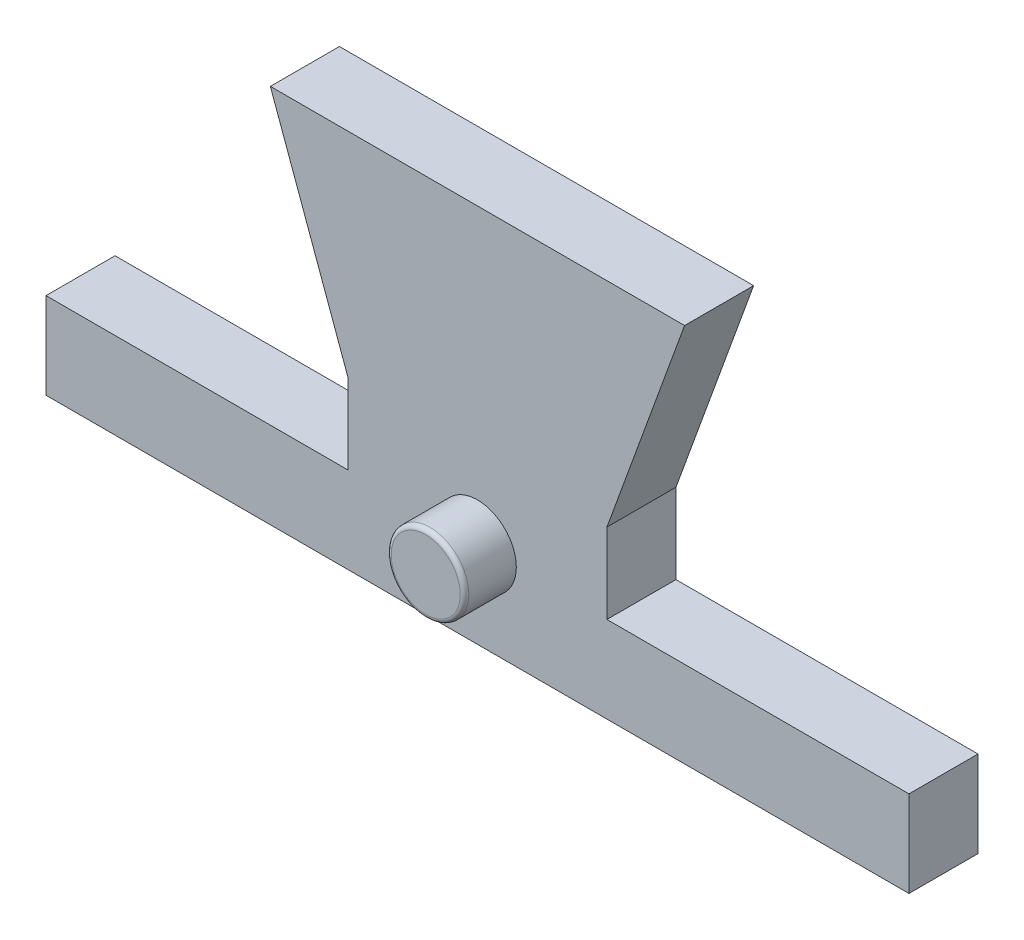
ISO-10303-21;
HEADER;
FILE_DESCRIPTION(('STEP AP214'),'2;1');
FILE_NAME('part.step','',(''),(''),'','','');
FILE_SCHEMA(('AUTOMOTIVE_DESIGN { 1 0 10303 214 1 1 1 1 }'));
ENDSEC;
DATA;
#1=APPLICATION_CONTEXT('core data for automotive mechanical design processes');
#2=APPLICATION_PROTOCOL_DEFINITION('international standard','automotive_design',2000,#1);
#3=PRODUCT_CONTEXT('',#1,'mechanical');
#4=PRODUCT('Part','Part','',(#3));
#5=PRODUCT_RELATED_PRODUCT_CATEGORY('part','',(#4));
#6=PRODUCT_DEFINITION_FORMATION('','',#4);
#7=PRODUCT_DEFINITION_CONTEXT('part definition',#1,'design');
#8=PRODUCT_DEFINITION('design','',#6,#7);
#9=PRODUCT_DEFINITION_SHAPE('','',#8);
#10=(LENGTH_UNIT() NAMED_UNIT(*) SI_UNIT(.MILLI.,.METRE.));
#11=(NAMED_UNIT(*) PLANE_ANGLE_UNIT() SI_UNIT($,.RADIAN.));
#12=(NAMED_UNIT(*) SI_UNIT($,.STERADIAN.) SOLID_ANGLE_UNIT());
#13=UNCERTAINTY_MEASURE_WITH_UNIT(LENGTH_MEASURE(1.E-05),#10,'distance_accuracy_value','');
#14=(GEOMETRIC_REPRESENTATION_CONTEXT(3) GLOBAL_UNCERTAINTY_ASSIGNED_CONTEXT((#13)) GLOBAL_UNIT_ASSIGNED_CONTEXT((#10,
#11,#12)) REPRESENTATION_CONTEXT('',''));
#15=CARTESIAN_POINT('',(0.,0.,0.));
#16=DIRECTION('',(0.,0.,1.));
#17=DIRECTION('',(1.,0.,0.));
#18=AXIS2_PLACEMENT_3D('',#15,#16,#17);
#19=CARTESIAN_POINT('',(0.,0.,4.));
#20=DIRECTION('',(1.,0.,0.));
#21=DIRECTION('',(0.,1.,0.));
#22=AXIS2_PLACEMENT_3D('',#19,#20,#21);
#23=PLANE('',#22);
#24=DIRECTION('',(0.,-1.,0.));
#25=VECTOR('',#24,1.);
#26=CARTESIAN_POINT('',(0.,0.,0.));
#27=LINE('',#26,#25);
#28=CARTESIAN_POINT('',(0.,5.,0.));
#29=VERTEX_POINT('',#28);
#30=CARTESIAN_POINT('',(0.,0.,0.));
#31=VERTEX_POINT('',#30);
#32=EDGE_CURVE('E153',#29,#31,#27,.T.);
#33=ORIENTED_EDGE('',*,*,#32,.F.);
#34=DIRECTION('',(0.,0.,-1.));
#35=VECTOR('',#34,1.);
#36=CARTESIAN_POINT('',(0.,5.,4.));
#37=LINE('',#36,#35);
#38=CARTESIAN_POINT('',(0.,5.,4.));
#39=VERTEX_POINT('',#38);
#40=EDGE_CURVE('E100',#39,#29,#37,.T.);
#41=ORIENTED_EDGE('',*,*,#40,.F.);
#42=DIRECTION('',(0.,-1.,0.));
#43=VECTOR('',#42,1.);
#44=CARTESIAN_POINT('',(0.,0.,4.));
#45=LINE('',#44,#43);
#46=CARTESIAN_POINT('',(0.,0.,4.));
#47=VERTEX_POINT('',#46);
#48=EDGE_CURVE('E190',#39,#47,#45,.T.);
#49=ORIENTED_EDGE('',*,*,#48,.T.);
#50=DIRECTION('',(0.,0.,-1.));
#51=VECTOR('',#50,1.);
#52=CARTESIAN_POINT('',(0.,0.,4.));
#53=LINE('',#52,#51);
#54=EDGE_CURVE('E59',#47,#31,#53,.T.);
#55=ORIENTED_EDGE('',*,*,#54,.T.);
#56=EDGE_LOOP('',(#33,#41,#49,#55));
#57=FACE_BOUND('',#56,.T.);
#58=ADVANCED_FACE('F41',(#57),#23,.T.);
#59=CARTESIAN_POINT('',(0.,5.,4.));
#60=DIRECTION('',(0.,1.,0.));
#61=DIRECTION('',(0.,0.,1.));
#62=AXIS2_PLACEMENT_3D('',#59,#60,#61);
#63=PLANE('',#62);
#64=DIRECTION('',(1.,0.,0.));
#65=VECTOR('',#64,1.);
#66=CARTESIAN_POINT('',(0.,5.,0.));
#67=LINE('',#66,#65);
#68=CARTESIAN_POINT('',(-17.5,5.,0.));
#69=VERTEX_POINT('',#68);
#70=EDGE_CURVE('E156',#69,#29,#67,.T.);
#71=ORIENTED_EDGE('',*,*,#70,.F.);
#72=DIRECTION('',(0.,0.,-1.));
#73=VECTOR('',#72,1.);
#74=CARTESIAN_POINT('',(-17.5,5.,4.));
#75=LINE('',#74,#73);
#76=CARTESIAN_POINT('',(-17.5,5.,4.));
#77=VERTEX_POINT('',#76);
#78=EDGE_CURVE('E209',#77,#69,#75,.T.);
#79=ORIENTED_EDGE('',*,*,#78,.F.);
#80=DIRECTION('',(1.,0.,0.));
#81=VECTOR('',#80,1.);
#82=CARTESIAN_POINT('',(0.,5.,4.));
#83=LINE('',#82,#81);
#84=EDGE_CURVE('E430',#77,#39,#83,.T.);
#85=ORIENTED_EDGE('',*,*,#84,.T.);
#86=ORIENTED_EDGE('',*,*,#40,.T.);
#87=EDGE_LOOP('',(#71,#79,#85,#86));
#88=FACE_BOUND('',#87,.T.);
#89=ADVANCED_FACE('F240',(#88),#63,.T.);
#90=CARTESIAN_POINT('',(-17.5,0.,4.));
#91=DIRECTION('',(1.,0.,0.));
#92=DIRECTION('',(0.,0.,-1.));
#93=AXIS2_PLACEMENT_3D('',#90,#91,#92);
#94=PLANE('',#93);
#95=DIRECTION('',(0.,-1.,0.));
#96=VECTOR('',#95,1.);
#97=CARTESIAN_POINT('',(-17.5,0.,0.));
#98=LINE('',#97,#96);
#99=CARTESIAN_POINT('',(-17.5,9.63635161245422,0.));
#100=VERTEX_POINT('',#99);
#101=EDGE_CURVE('E161',#100,#69,#98,.T.);
#102=ORIENTED_EDGE('',*,*,#101,.F.);
#103=DIRECTION('',(0.,0.,-1.));
#104=VECTOR('',#103,1.);
#105=CARTESIAN_POINT('',(-17.5,9.63635161245422,4.));
#106=LINE('',#105,#104);
#107=CARTESIAN_POINT('',(-17.5,9.63635161245422,4.));
#108=VERTEX_POINT('',#107);
#109=EDGE_CURVE('E206',#108,#100,#106,.T.);
#110=ORIENTED_EDGE('',*,*,#109,.F.);
#111=DIRECTION('',(0.,-1.,0.));
#112=VECTOR('',#111,1.);
#113=CARTESIAN_POINT('',(-17.5,0.,4.));
#114=LINE('',#113,#112);
#115=EDGE_CURVE('E434',#108,#77,#114,.T.);
#116=ORIENTED_EDGE('',*,*,#115,.T.);
#117=ORIENTED_EDGE('',*,*,#78,.T.);
#118=EDGE_LOOP('',(#102,#110,#116,#117));
#119=FACE_BOUND('',#118,.T.);
#120=ADVANCED_FACE('F245',(#119),#94,.T.);
#121=CARTESIAN_POINT('',(-18.5499525868253,6.75163058865377,4.));
#122=DIRECTION('',(0.939692620785908,-0.342020143325669,0.));
#123=DIRECTION('',(0.342020143325669,0.939692620785908,0.));
#124=AXIS2_PLACEMENT_3D('',#121,#122,#123);
#125=PLANE('',#124);
#126=DIRECTION('',(-0.34202014332567,-0.939692620785908,0.));
#127=VECTOR('',#126,1.);
#128=CARTESIAN_POINT('',(-18.5499525868253,6.75163058865377,0.));
#129=LINE('',#128,#127);
#130=CARTESIAN_POINT('',(-13.,22.,0.));
#131=VERTEX_POINT('',#130);
#132=EDGE_CURVE('E165',#131,#100,#129,.T.);
#133=ORIENTED_EDGE('',*,*,#132,.F.);
#134=DIRECTION('',(0.,0.,-1.));
#135=VECTOR('',#134,1.);
#136=CARTESIAN_POINT('',(-13.,22.,4.));
#137=LINE('',#136,#135);
#138=CARTESIAN_POINT('',(-13.,22.,4.));
#139=VERTEX_POINT('',#138);
#140=EDGE_CURVE('E203',#139,#131,#137,.T.);
#141=ORIENTED_EDGE('',*,*,#140,.F.);
#142=DIRECTION('',(-0.34202014332567,-0.939692620785908,0.));
#143=VECTOR('',#142,1.);
#144=CARTESIAN_POINT('',(-18.5499525868253,6.75163058865377,4.));
#145=LINE('',#144,#143);
#146=EDGE_CURVE('E438',#139,#108,#145,.T.);
#147=ORIENTED_EDGE('',*,*,#146,.T.);
#148=ORIENTED_EDGE('',*,*,#109,.T.);
#149=EDGE_LOOP('',(#133,#141,#147,#148));
#150=FACE_BOUND('',#149,.T.);
#151=ADVANCED_FACE('F251',(#150),#125,.T.);
#152=CARTESIAN_POINT('',(0.,22.,4.));
#153=DIRECTION('',(0.,1.,0.));
#154=DIRECTION('',(0.,0.,1.));
#155=AXIS2_PLACEMENT_3D('',#152,#153,#154);
#156=PLANE('',#155);
#157=DIRECTION('',(1.,0.,0.));
#158=VECTOR('',#157,1.);
#159=CARTESIAN_POINT('',(0.,22.,0.));
#160=LINE('',#159,#158);
#161=CARTESIAN_POINT('',(-37.,22.,0.));
#162=VERTEX_POINT('',#161);
#163=EDGE_CURVE('E169',#162,#131,#160,.T.);
#164=ORIENTED_EDGE('',*,*,#163,.F.);
#165=DIRECTION('',(0.,0.,-1.));
#166=VECTOR('',#165,1.);
#167=CARTESIAN_POINT('',(-37.,22.,4.));
#168=LINE('',#167,#166);
#169=CARTESIAN_POINT('',(-37.,22.,4.));
#170=VERTEX_POINT('',#169);
#171=EDGE_CURVE('E200',#170,#162,#168,.T.);
#172=ORIENTED_EDGE('',*,*,#171,.F.);
#173=DIRECTION('',(1.,0.,0.));
#174=VECTOR('',#173,1.);
#175=CARTESIAN_POINT('',(0.,22.,4.));
#176=LINE('',#175,#174);
#177=EDGE_CURVE('E446',#170,#139,#176,.T.);
#178=ORIENTED_EDGE('',*,*,#177,.T.);
#179=ORIENTED_EDGE('',*,*,#140,.T.);
#180=EDGE_LOOP('',(#164,#172,#178,#179));
#181=FACE_BOUND('',#180,.T.);
#182=ADVANCED_FACE('F255',(#181),#156,.T.);
#183=CARTESIAN_POINT('',(-25.6011584911494,-9.31805965350965,4.));
#184=DIRECTION('',(0.939692620785911,0.342020143325663,0.));
#185=DIRECTION('',(-0.342020143325663,0.939692620785911,0.));
#186=AXIS2_PLACEMENT_3D('',#183,#184,#185);
#187=PLANE('',#186);
#188=DIRECTION('',(0.342020143325663,-0.939692620785911,0.));
#189=VECTOR('',#188,1.);
#190=CARTESIAN_POINT('',(-25.6011584911494,-9.31805965350965,0.));
#191=LINE('',#190,#189);
#192=CARTESIAN_POINT('',(-32.5,9.63635161245397,0.));
#193=VERTEX_POINT('',#192);
#194=EDGE_CURVE('E173',#162,#193,#191,.T.);
#195=ORIENTED_EDGE('',*,*,#194,.T.);
#196=DIRECTION('',(0.,0.,-1.));
#197=VECTOR('',#196,1.);
#198=CARTESIAN_POINT('',(-32.5,9.63635161245397,4.));
#199=LINE('',#198,#197);
#200=CARTESIAN_POINT('',(-32.5,9.63635161245397,4.));
#201=VERTEX_POINT('',#200);
#202=EDGE_CURVE('E197',#201,#193,#199,.T.);
#203=ORIENTED_EDGE('',*,*,#202,.F.);
#204=DIRECTION('',(0.342020143325663,-0.939692620785911,0.));
#205=VECTOR('',#204,1.);
#206=CARTESIAN_POINT('',(-25.6011584911494,-9.31805965350965,4.));
#207=LINE('',#206,#205);
#208=EDGE_CURVE('E450',#170,#201,#207,.T.);
#209=ORIENTED_EDGE('',*,*,#208,.F.);
#210=ORIENTED_EDGE('',*,*,#171,.T.);
#211=EDGE_LOOP('',(#195,#203,#209,#210));
#212=FACE_BOUND('',#211,.T.);
#213=ADVANCED_FACE('F259',(#212),#187,.F.);
#214=CARTESIAN_POINT('',(-32.5,0.,4.));
#215=DIRECTION('',(-1.,0.,0.));
#216=DIRECTION('',(0.,0.,1.));
#217=AXIS2_PLACEMENT_3D('',#214,#215,#216);
#218=PLANE('',#217);
#219=DIRECTION('',(0.,1.,0.));
#220=VECTOR('',#219,1.);
#221=CARTESIAN_POINT('',(-32.5,0.,0.));
#222=LINE('',#221,#220);
#223=CARTESIAN_POINT('',(-32.5,5.,0.));
#224=VERTEX_POINT('',#223);
#225=EDGE_CURVE('E177',#224,#193,#222,.T.);
#226=ORIENTED_EDGE('',*,*,#225,.F.);
#227=DIRECTION('',(0.,0.,-1.));
#228=VECTOR('',#227,1.);
#229=CARTESIAN_POINT('',(-32.5,5.,4.));
#230=LINE('',#229,#228);
#231=CARTESIAN_POINT('',(-32.5,5.,4.));
#232=VERTEX_POINT('',#231);
#233=EDGE_CURVE('E133',#232,#224,#230,.T.);
#234=ORIENTED_EDGE('',*,*,#233,.F.);
#235=DIRECTION('',(0.,1.,0.));
#236=VECTOR('',#235,1.);
#237=CARTESIAN_POINT('',(-32.5,0.,4.));
#238=LINE('',#237,#236);
#239=EDGE_CURVE('E142',#232,#201,#238,.T.);
#240=ORIENTED_EDGE('',*,*,#239,.T.);
#241=ORIENTED_EDGE('',*,*,#202,.T.);
#242=EDGE_LOOP('',(#226,#234,#240,#241));
#243=FACE_BOUND('',#242,.T.);
#244=ADVANCED_FACE('F263',(#243),#218,.T.);
#245=CARTESIAN_POINT('',(0.,5.,4.));
#246=DIRECTION('',(0.,1.,0.));
#247=DIRECTION('',(0.,0.,1.));
#248=AXIS2_PLACEMENT_3D('',#245,#246,#247);
#249=PLANE('',#248);
#250=DIRECTION('',(1.,0.,0.));
#251=VECTOR('',#250,1.);
#252=CARTESIAN_POINT('',(0.,5.,0.));
#253=LINE('',#252,#251);
#254=CARTESIAN_POINT('',(-50.,5.,0.));
#255=VERTEX_POINT('',#254);
#256=EDGE_CURVE('E128',#255,#224,#253,.T.);
#257=ORIENTED_EDGE('',*,*,#256,.F.);
#258=DIRECTION('',(0.,0.,-1.));
#259=VECTOR('',#258,1.);
#260=CARTESIAN_POINT('',(-50.,5.,4.));
#261=LINE('',#260,#259);
#262=CARTESIAN_POINT('',(-50.,5.,4.));
#263=VERTEX_POINT('',#262);
#264=EDGE_CURVE('E123',#263,#255,#261,.T.);
#265=ORIENTED_EDGE('',*,*,#264,.F.);
#266=DIRECTION('',(1.,0.,0.));
#267=VECTOR('',#266,1.);
#268=CARTESIAN_POINT('',(0.,5.,4.));
#269=LINE('',#268,#267);
#270=EDGE_CURVE('E126',#263,#232,#269,.T.);
#271=ORIENTED_EDGE('',*,*,#270,.T.);
#272=ORIENTED_EDGE('',*,*,#233,.T.);
#273=EDGE_LOOP('',(#257,#265,#271,#272));
#274=FACE_BOUND('',#273,.T.);
#275=ADVANCED_FACE('F125',(#274),#249,.T.);
#276=CARTESIAN_POINT('',(-50.,0.,4.));
#277=DIRECTION('',(-1.,0.,0.));
#278=DIRECTION('',(0.,0.,1.));
#279=AXIS2_PLACEMENT_3D('',#276,#277,#278);
#280=PLANE('',#279);
#281=DIRECTION('',(0.,1.,0.));
#282=VECTOR('',#281,1.);
#283=CARTESIAN_POINT('',(-50.,0.,0.));
#284=LINE('',#283,#282);
#285=CARTESIAN_POINT('',(-50.,0.,0.));
#286=VERTEX_POINT('',#285);
#287=EDGE_CURVE('E183',#286,#255,#284,.T.);
#288=ORIENTED_EDGE('',*,*,#287,.F.);
#289=DIRECTION('',(0.,0.,-1.));
#290=VECTOR('',#289,1.);
#291=CARTESIAN_POINT('',(-50.,0.,4.));
#292=LINE('',#291,#290);
#293=CARTESIAN_POINT('',(-50.,0.,4.));
#294=VERTEX_POINT('',#293);
#295=EDGE_CURVE('E91',#294,#286,#292,.T.);
#296=ORIENTED_EDGE('',*,*,#295,.F.);
#297=DIRECTION('',(0.,1.,0.));
#298=VECTOR('',#297,1.);
#299=CARTESIAN_POINT('',(-50.,0.,4.));
#300=LINE('',#299,#298);
#301=EDGE_CURVE('E140',#294,#263,#300,.T.);
#302=ORIENTED_EDGE('',*,*,#301,.T.);
#303=ORIENTED_EDGE('',*,*,#264,.T.);
#304=EDGE_LOOP('',(#288,#296,#302,#303));
#305=FACE_BOUND('',#304,.T.);
#306=ADVANCED_FACE('F145',(#305),#280,.T.);
#307=CARTESIAN_POINT('',(0.,0.,4.));
#308=DIRECTION('',(0.,-1.,0.));
#309=DIRECTION('',(1.,0.,0.));
#310=AXIS2_PLACEMENT_3D('',#307,#308,#309);
#311=PLANE('',#310);
#312=DIRECTION('',(-1.,0.,0.));
#313=VECTOR('',#312,1.);
#314=CARTESIAN_POINT('',(0.,0.,0.));
#315=LINE('',#314,#313);
#316=EDGE_CURVE('E186',#31,#286,#315,.T.);
#317=ORIENTED_EDGE('',*,*,#316,.F.);
#318=ORIENTED_EDGE('',*,*,#54,.F.);
#319=DIRECTION('',(-1.,0.,0.));
#320=VECTOR('',#319,1.);
#321=CARTESIAN_POINT('',(0.,0.,4.));
#322=LINE('',#321,#320);
#323=EDGE_CURVE('E147',#47,#294,#322,.T.);
#324=ORIENTED_EDGE('',*,*,#323,.T.);
#325=ORIENTED_EDGE('',*,*,#295,.T.);
#326=EDGE_LOOP('',(#317,#318,#324,#325));
#327=FACE_BOUND('',#326,.T.);
#328=ADVANCED_FACE('F272',(#327),#311,.T.);
#329=CARTESIAN_POINT('',(0.,0.,4.));
#330=DIRECTION('',(0.,0.,1.));
#331=DIRECTION('',(1.,0.,0.));
#332=AXIS2_PLACEMENT_3D('',#329,#330,#331);
#333=PLANE('',#332);
#334=CARTESIAN_POINT('',(-25.,5.,4.));
#335=DIRECTION('',(0.,0.,1.));
#336=DIRECTION('',(1.,0.,0.));
#337=AXIS2_PLACEMENT_3D('',#334,#335,#336);
#338=CIRCLE('',#337,2.25);
#339=CARTESIAN_POINT('',(-22.75,5.,4.));
#340=VERTEX_POINT('',#339);
#341=EDGE_CURVE('E214',#340,#340,#338,.T.);
#342=ORIENTED_EDGE('',*,*,#341,.F.);
#343=EDGE_LOOP('',(#342));
#344=FACE_BOUND('',#343,.T.);
#345=ORIENTED_EDGE('',*,*,#48,.F.);
#346=ORIENTED_EDGE('',*,*,#84,.F.);
#347=ORIENTED_EDGE('',*,*,#115,.F.);
#348=ORIENTED_EDGE('',*,*,#146,.F.);
#349=ORIENTED_EDGE('',*,*,#177,.F.);
#350=ORIENTED_EDGE('',*,*,#208,.T.);
#351=ORIENTED_EDGE('',*,*,#239,.F.);
#352=ORIENTED_EDGE('',*,*,#270,.F.);
#353=ORIENTED_EDGE('',*,*,#301,.F.);
#354=ORIENTED_EDGE('',*,*,#323,.F.);
#355=EDGE_LOOP('',(#345,#346,#347,#348,#349,#350,#351,#352,#353,#354));
#356=FACE_BOUND('',#355,.T.);
#357=ADVANCED_FACE('F138',(#344,#356),#333,.T.);
#358=CARTESIAN_POINT('',(0.,0.,0.));
#359=DIRECTION('',(0.,0.,1.));
#360=DIRECTION('',(1.,0.,0.));
#361=AXIS2_PLACEMENT_3D('',#358,#359,#360);
#362=PLANE('',#361);
#363=CARTESIAN_POINT('',(-25.,5.,0.));
#364=DIRECTION('',(0.,0.,1.));
#365=DIRECTION('',(1.,0.,0.));
#366=AXIS2_PLACEMENT_3D('',#363,#364,#365);
#367=CIRCLE('',#366,2.25);
#368=CARTESIAN_POINT('',(-22.75,5.,0.));
#369=VERTEX_POINT('',#368);
#370=EDGE_CURVE('E157',#369,#369,#367,.T.);
#371=ORIENTED_EDGE('',*,*,#370,.T.);
#372=EDGE_LOOP('',(#371));
#373=FACE_BOUND('',#372,.T.);
#374=ORIENTED_EDGE('',*,*,#32,.T.);
#375=ORIENTED_EDGE('',*,*,#316,.T.);
#376=ORIENTED_EDGE('',*,*,#287,.T.);
#377=ORIENTED_EDGE('',*,*,#256,.T.);
#378=ORIENTED_EDGE('',*,*,#225,.T.);
#379=ORIENTED_EDGE('',*,*,#194,.F.);
#380=ORIENTED_EDGE('',*,*,#163,.T.);
#381=ORIENTED_EDGE('',*,*,#132,.T.);
#382=ORIENTED_EDGE('',*,*,#101,.T.);
#383=ORIENTED_EDGE('',*,*,#70,.T.);
#384=EDGE_LOOP('',(#374,#375,#376,#377,#378,#379,#380,#381,#382,#383));
#385=FACE_BOUND('',#384,.T.);
#386=ADVANCED_FACE('F275',(#373,#385),#362,.F.);
#387=CARTESIAN_POINT('',(0.,0.,-3.));
#388=DIRECTION('',(0.,0.,1.));
#389=DIRECTION('',(1.,0.,0.));
#390=AXIS2_PLACEMENT_3D('',#387,#388,#389);
#391=PLANE('',#390);
#392=CARTESIAN_POINT('',(-25.,5.,-3.));
#393=DIRECTION('',(0.,0.,1.));
#394=DIRECTION('',(1.,0.,0.));
#395=AXIS2_PLACEMENT_3D('',#392,#393,#394);
#396=CIRCLE('',#395,2.);
#397=CARTESIAN_POINT('',(-23.,5.,-3.));
#398=VERTEX_POINT('',#397);
#399=EDGE_CURVE('E222',#398,#398,#396,.F.);
#400=ORIENTED_EDGE('',*,*,#399,.T.);
#401=EDGE_LOOP('',(#400));
#402=FACE_BOUND('',#401,.T.);
#403=ADVANCED_FACE('F278',(#402),#391,.F.);
#404=CARTESIAN_POINT('',(-25.,5.,-3.));
#405=DIRECTION('',(0.,0.,1.));
#406=DIRECTION('',(1.,0.,0.));
#407=AXIS2_PLACEMENT_3D('',#404,#405,#406);
#408=CYLINDRICAL_SURFACE('',#407,2.25);
#409=CARTESIAN_POINT('',(-25.,5.,-2.75));
#410=DIRECTION('',(0.,0.,1.));
#411=DIRECTION('',(1.,0.,0.));
#412=AXIS2_PLACEMENT_3D('',#409,#410,#411);
#413=CIRCLE('',#412,2.25);
#414=CARTESIAN_POINT('',(-22.75,5.,-2.75));
#415=VERTEX_POINT('',#414);
#416=EDGE_CURVE('E218',#415,#415,#413,.T.);
#417=ORIENTED_EDGE('',*,*,#416,.T.);
#418=EDGE_LOOP('',(#417));
#419=FACE_BOUND('',#418,.T.);
#420=ORIENTED_EDGE('',*,*,#370,.F.);
#421=EDGE_LOOP('',(#420));
#422=FACE_BOUND('',#421,.T.);
#423=ADVANCED_FACE('F286',(#419,#422),#408,.T.);
#424=CARTESIAN_POINT('',(-25.,5.,6.75));
#425=DIRECTION('',(0.,0.,1.));
#426=DIRECTION('',(1.,0.,0.));
#427=AXIS2_PLACEMENT_3D('',#424,#425,#426);
#428=CIRCLE('',#427,2.25);
#429=CARTESIAN_POINT('',(-22.75,5.,6.75));
#430=VERTEX_POINT('',#429);
#431=EDGE_CURVE('E11',#430,#430,#428,.F.);
#432=ORIENTED_EDGE('',*,*,#431,.T.);
#433=EDGE_LOOP('',(#432));
#434=FACE_BOUND('',#433,.T.);
#435=ORIENTED_EDGE('',*,*,#341,.T.);
#436=EDGE_LOOP('',(#435));
#437=FACE_BOUND('',#436,.T.);
#438=ADVANCED_FACE('F283',(#434,#437),#408,.T.);
#439=CARTESIAN_POINT('',(0.,0.,7.));
#440=DIRECTION('',(0.,0.,1.));
#441=DIRECTION('',(1.,0.,0.));
#442=AXIS2_PLACEMENT_3D('',#439,#440,#441);
#443=PLANE('',#442);
#444=CARTESIAN_POINT('',(-25.,5.,7.));
#445=DIRECTION('',(0.,0.,1.));
#446=DIRECTION('',(1.,0.,0.));
#447=AXIS2_PLACEMENT_3D('',#444,#445,#446);
#448=CIRCLE('',#447,2.);
#449=CARTESIAN_POINT('',(-23.,5.,7.));
#450=VERTEX_POINT('',#449);
#451=EDGE_CURVE('E51',#450,#450,#448,.T.);
#452=ORIENTED_EDGE('',*,*,#451,.T.);
#453=EDGE_LOOP('',(#452));
#454=FACE_BOUND('',#453,.T.);
#455=ADVANCED_FACE('F229',(#454),#443,.T.);
#456=CARTESIAN_POINT('',(-25.,5.,-2.75));
#457=DIRECTION('',(0.,0.,1.));
#458=DIRECTION('',(1.,0.,0.));
#459=AXIS2_PLACEMENT_3D('',#456,#457,#458);
#460=TOROIDAL_SURFACE('',#459,2.,0.25);
#461=ORIENTED_EDGE('',*,*,#399,.F.);
#462=EDGE_LOOP('',(#461));
#463=FACE_BOUND('',#462,.T.);
#464=ORIENTED_EDGE('',*,*,#416,.F.);
#465=EDGE_LOOP('',(#464));
#466=FACE_BOUND('',#465,.T.);
#467=ADVANCED_FACE('F232',(#463,#466),#460,.T.);
#468=CARTESIAN_POINT('',(-25.,5.,6.75));
#469=DIRECTION('',(0.,0.,1.));
#470=DIRECTION('',(1.,0.,0.));
#471=AXIS2_PLACEMENT_3D('',#468,#469,#470);
#472=TOROIDAL_SURFACE('',#471,2.,0.25);
#473=ORIENTED_EDGE('',*,*,#431,.F.);
#474=EDGE_LOOP('',(#473));
#475=FACE_BOUND('',#474,.T.);
#476=ORIENTED_EDGE('',*,*,#451,.F.);
#477=EDGE_LOOP('',(#476));
#478=FACE_BOUND('',#477,.T.);
#479=ADVANCED_FACE('F43',(#475,#478),#472,.T.);
#480=CLOSED_SHELL('',(#58,#89,#120,#151,#182,#213,#244,#275,#306,#328,#357,#386,#403,#423,#438,
#455,#467,#479));
#481=MANIFOLD_SOLID_BREP('B2',#480);
#482=ADVANCED_BREP_SHAPE_REPRESENTATION('',(#18,#481),#14);
#483=SHAPE_DEFINITION_REPRESENTATION(#9,#482);
ENDSEC;
END-ISO-10303-21;
